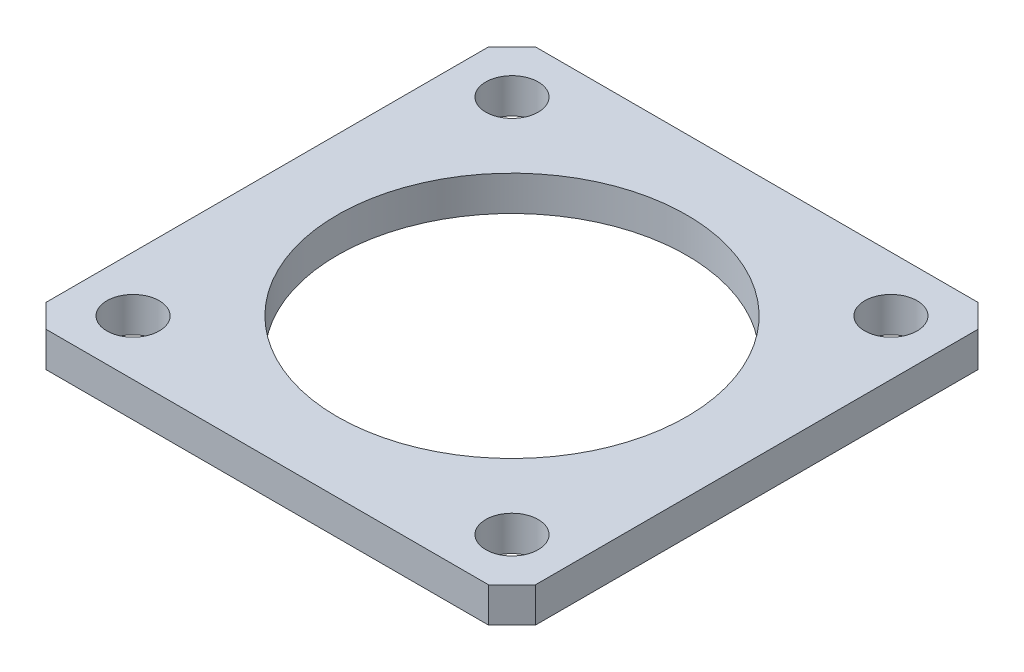
ISO-10303-21;
HEADER;
FILE_DESCRIPTION(('STEP AP214'),'2;1');
FILE_NAME('part.step','',(''),(''),'','','');
FILE_SCHEMA(('AUTOMOTIVE_DESIGN { 1 0 10303 214 1 1 1 1 }'));
ENDSEC;
DATA;
#1=APPLICATION_CONTEXT('core data for automotive mechanical design processes');
#2=APPLICATION_PROTOCOL_DEFINITION('international standard','automotive_design',2000,#1);
#3=PRODUCT_CONTEXT('',#1,'mechanical');
#4=PRODUCT('Part','Part','',(#3));
#5=PRODUCT_RELATED_PRODUCT_CATEGORY('part','',(#4));
#6=PRODUCT_DEFINITION_FORMATION('','',#4);
#7=PRODUCT_DEFINITION_CONTEXT('part definition',#1,'design');
#8=PRODUCT_DEFINITION('design','',#6,#7);
#9=PRODUCT_DEFINITION_SHAPE('','',#8);
#10=(LENGTH_UNIT() NAMED_UNIT(*) SI_UNIT(.MILLI.,.METRE.));
#11=(NAMED_UNIT(*) PLANE_ANGLE_UNIT() SI_UNIT($,.RADIAN.));
#12=(NAMED_UNIT(*) SI_UNIT($,.STERADIAN.) SOLID_ANGLE_UNIT());
#13=UNCERTAINTY_MEASURE_WITH_UNIT(LENGTH_MEASURE(1.E-05),#10,'distance_accuracy_value','');
#14=(GEOMETRIC_REPRESENTATION_CONTEXT(3) GLOBAL_UNCERTAINTY_ASSIGNED_CONTEXT((#13)) GLOBAL_UNIT_ASSIGNED_CONTEXT((#10,
#11,#12)) REPRESENTATION_CONTEXT('',''));
#15=CARTESIAN_POINT('',(0.,0.,0.));
#16=DIRECTION('',(0.,0.,1.));
#17=DIRECTION('',(1.,0.,0.));
#18=AXIS2_PLACEMENT_3D('',#15,#16,#17);
#19=CARTESIAN_POINT('',(0.,3.,0.));
#20=DIRECTION('',(0.,1.,0.));
#21=DIRECTION('',(0.,0.,1.));
#22=AXIS2_PLACEMENT_3D('',#19,#20,#21);
#23=PLANE('',#22);
#24=CARTESIAN_POINT('',(-16.2634559672906,3.,16.2634559672906));
#25=DIRECTION('',(0.,1.,0.));
#26=DIRECTION('',(0.,0.,1.));
#27=AXIS2_PLACEMENT_3D('',#24,#25,#26);
#28=CIRCLE('',#27,2.25);
#29=CARTESIAN_POINT('',(-16.2634559672906,3.,18.5134559672906));
#30=VERTEX_POINT('',#29);
#31=EDGE_CURVE('E197',#30,#30,#28,.T.);
#32=ORIENTED_EDGE('',*,*,#31,.F.);
#33=EDGE_LOOP('',(#32));
#34=FACE_BOUND('',#33,.T.);
#35=CARTESIAN_POINT('',(16.2634559672906,3.,-16.2634559672906));
#36=DIRECTION('',(0.,1.,0.));
#37=DIRECTION('',(0.,0.,1.));
#38=AXIS2_PLACEMENT_3D('',#35,#36,#37);
#39=CIRCLE('',#38,2.25);
#40=CARTESIAN_POINT('',(16.2634559672906,3.,-14.0134559672906));
#41=VERTEX_POINT('',#40);
#42=EDGE_CURVE('E185',#41,#41,#39,.T.);
#43=ORIENTED_EDGE('',*,*,#42,.F.);
#44=EDGE_LOOP('',(#43));
#45=FACE_BOUND('',#44,.T.);
#46=DIRECTION('',(0.,0.,-1.));
#47=VECTOR('',#46,1.);
#48=CARTESIAN_POINT('',(21.,3.,-19.));
#49=LINE('',#48,#47);
#50=CARTESIAN_POINT('',(21.,3.,19.));
#51=VERTEX_POINT('',#50);
#52=CARTESIAN_POINT('',(21.,3.,-19.));
#53=VERTEX_POINT('',#52);
#54=EDGE_CURVE('E148',#51,#53,#49,.T.);
#55=ORIENTED_EDGE('',*,*,#54,.T.);
#56=DIRECTION('',(-0.707106781186548,0.,-0.707106781186548));
#57=VECTOR('',#56,1.);
#58=CARTESIAN_POINT('',(19.,3.,-21.));
#59=LINE('',#58,#57);
#60=CARTESIAN_POINT('',(19.,3.,-21.));
#61=VERTEX_POINT('',#60);
#62=EDGE_CURVE('E96',#53,#61,#59,.T.);
#63=ORIENTED_EDGE('',*,*,#62,.T.);
#64=DIRECTION('',(-1.,0.,0.));
#65=VECTOR('',#64,1.);
#66=CARTESIAN_POINT('',(-19.,3.,-21.));
#67=LINE('',#66,#65);
#68=CARTESIAN_POINT('',(-19.,3.,-21.));
#69=VERTEX_POINT('',#68);
#70=EDGE_CURVE('E163',#61,#69,#67,.T.);
#71=ORIENTED_EDGE('',*,*,#70,.T.);
#72=DIRECTION('',(-0.707106781186548,0.,0.707106781186548));
#73=VECTOR('',#72,1.);
#74=CARTESIAN_POINT('',(-19.,3.,-21.));
#75=LINE('',#74,#73);
#76=CARTESIAN_POINT('',(-21.,3.,-19.));
#77=VERTEX_POINT('',#76);
#78=EDGE_CURVE('E176',#69,#77,#75,.T.);
#79=ORIENTED_EDGE('',*,*,#78,.T.);
#80=DIRECTION('',(0.,0.,1.));
#81=VECTOR('',#80,1.);
#82=CARTESIAN_POINT('',(-21.,3.,-19.));
#83=LINE('',#82,#81);
#84=CARTESIAN_POINT('',(-21.,3.,19.));
#85=VERTEX_POINT('',#84);
#86=EDGE_CURVE('E115',#77,#85,#83,.T.);
#87=ORIENTED_EDGE('',*,*,#86,.T.);
#88=DIRECTION('',(0.707106781186547,0.,0.707106781186548));
#89=VECTOR('',#88,1.);
#90=CARTESIAN_POINT('',(-21.,3.,19.));
#91=LINE('',#90,#89);
#92=CARTESIAN_POINT('',(-19.,3.,21.));
#93=VERTEX_POINT('',#92);
#94=EDGE_CURVE('E109',#85,#93,#91,.T.);
#95=ORIENTED_EDGE('',*,*,#94,.T.);
#96=DIRECTION('',(1.,0.,0.));
#97=VECTOR('',#96,1.);
#98=CARTESIAN_POINT('',(-19.,3.,21.));
#99=LINE('',#98,#97);
#100=CARTESIAN_POINT('',(19.,3.,21.));
#101=VERTEX_POINT('',#100);
#102=EDGE_CURVE('E113',#93,#101,#99,.T.);
#103=ORIENTED_EDGE('',*,*,#102,.T.);
#104=DIRECTION('',(0.707106781186548,0.,-0.707106781186547));
#105=VECTOR('',#104,1.);
#106=CARTESIAN_POINT('',(21.,3.,19.));
#107=LINE('',#106,#105);
#108=EDGE_CURVE('E53',#101,#51,#107,.T.);
#109=ORIENTED_EDGE('',*,*,#108,.T.);
#110=EDGE_LOOP('',(#55,#63,#71,#79,#87,#95,#103,#109));
#111=FACE_BOUND('',#110,.T.);
#112=CARTESIAN_POINT('',(-16.2634559672906,3.,-16.2634559672906));
#113=DIRECTION('',(0.,1.,0.));
#114=DIRECTION('',(0.,0.,1.));
#115=AXIS2_PLACEMENT_3D('',#112,#113,#114);
#116=CIRCLE('',#115,2.25);
#117=CARTESIAN_POINT('',(-16.2634559672906,3.,-14.0134559672906));
#118=VERTEX_POINT('',#117);
#119=EDGE_CURVE('E137',#118,#118,#116,.T.);
#120=ORIENTED_EDGE('',*,*,#119,.F.);
#121=EDGE_LOOP('',(#120));
#122=FACE_BOUND('',#121,.T.);
#123=CARTESIAN_POINT('',(16.2634559672906,3.,16.2634559672906));
#124=DIRECTION('',(0.,1.,0.));
#125=DIRECTION('',(0.,0.,1.));
#126=AXIS2_PLACEMENT_3D('',#123,#124,#125);
#127=CIRCLE('',#126,2.25);
#128=CARTESIAN_POINT('',(16.2634559672906,3.,18.5134559672906));
#129=VERTEX_POINT('',#128);
#130=EDGE_CURVE('E191',#129,#129,#127,.T.);
#131=ORIENTED_EDGE('',*,*,#130,.F.);
#132=EDGE_LOOP('',(#131));
#133=FACE_BOUND('',#132,.T.);
#134=CARTESIAN_POINT('',(0.,3.,0.));
#135=DIRECTION('',(0.,1.,0.));
#136=DIRECTION('',(0.,0.,1.));
#137=AXIS2_PLACEMENT_3D('',#134,#135,#136);
#138=CIRCLE('',#137,15.);
#139=CARTESIAN_POINT('',(0.,3.,15.));
#140=VERTEX_POINT('',#139);
#141=EDGE_CURVE('E203',#140,#140,#138,.T.);
#142=ORIENTED_EDGE('',*,*,#141,.F.);
#143=EDGE_LOOP('',(#142));
#144=FACE_BOUND('',#143,.T.);
#145=ADVANCED_FACE('F36',(#34,#45,#111,#122,#133,#144),#23,.T.);
#146=CARTESIAN_POINT('',(0.,0.,0.));
#147=DIRECTION('',(0.,1.,0.));
#148=DIRECTION('',(0.,0.,1.));
#149=AXIS2_PLACEMENT_3D('',#146,#147,#148);
#150=PLANE('',#149);
#151=DIRECTION('',(0.,0.,-1.));
#152=VECTOR('',#151,1.);
#153=CARTESIAN_POINT('',(21.,0.,-19.));
#154=LINE('',#153,#152);
#155=CARTESIAN_POINT('',(21.,0.,19.));
#156=VERTEX_POINT('',#155);
#157=CARTESIAN_POINT('',(21.,0.,-19.));
#158=VERTEX_POINT('',#157);
#159=EDGE_CURVE('E133',#156,#158,#154,.T.);
#160=ORIENTED_EDGE('',*,*,#159,.F.);
#161=DIRECTION('',(0.707106781186548,0.,-0.707106781186547));
#162=VECTOR('',#161,1.);
#163=CARTESIAN_POINT('',(21.,0.,19.));
#164=LINE('',#163,#162);
#165=CARTESIAN_POINT('',(19.,0.,21.));
#166=VERTEX_POINT('',#165);
#167=EDGE_CURVE('E88',#166,#156,#164,.T.);
#168=ORIENTED_EDGE('',*,*,#167,.F.);
#169=DIRECTION('',(1.,0.,0.));
#170=VECTOR('',#169,1.);
#171=CARTESIAN_POINT('',(-19.,0.,21.));
#172=LINE('',#171,#170);
#173=CARTESIAN_POINT('',(-19.,0.,21.));
#174=VERTEX_POINT('',#173);
#175=EDGE_CURVE('E82',#174,#166,#172,.T.);
#176=ORIENTED_EDGE('',*,*,#175,.F.);
#177=DIRECTION('',(0.707106781186547,0.,0.707106781186548));
#178=VECTOR('',#177,1.);
#179=CARTESIAN_POINT('',(-21.,0.,19.));
#180=LINE('',#179,#178);
#181=CARTESIAN_POINT('',(-21.,0.,19.));
#182=VERTEX_POINT('',#181);
#183=EDGE_CURVE('E123',#182,#174,#180,.T.);
#184=ORIENTED_EDGE('',*,*,#183,.F.);
#185=DIRECTION('',(0.,0.,1.));
#186=VECTOR('',#185,1.);
#187=CARTESIAN_POINT('',(-21.,0.,-19.));
#188=LINE('',#187,#186);
#189=CARTESIAN_POINT('',(-21.,0.,-19.));
#190=VERTEX_POINT('',#189);
#191=EDGE_CURVE('E143',#190,#182,#188,.T.);
#192=ORIENTED_EDGE('',*,*,#191,.F.);
#193=DIRECTION('',(-0.707106781186548,0.,0.707106781186548));
#194=VECTOR('',#193,1.);
#195=CARTESIAN_POINT('',(-19.,0.,-21.));
#196=LINE('',#195,#194);
#197=CARTESIAN_POINT('',(-19.,0.,-21.));
#198=VERTEX_POINT('',#197);
#199=EDGE_CURVE('E141',#198,#190,#196,.T.);
#200=ORIENTED_EDGE('',*,*,#199,.F.);
#201=DIRECTION('',(-1.,0.,0.));
#202=VECTOR('',#201,1.);
#203=CARTESIAN_POINT('',(-19.,0.,-21.));
#204=LINE('',#203,#202);
#205=CARTESIAN_POINT('',(19.,0.,-21.));
#206=VERTEX_POINT('',#205);
#207=EDGE_CURVE('E139',#206,#198,#204,.T.);
#208=ORIENTED_EDGE('',*,*,#207,.F.);
#209=DIRECTION('',(-0.707106781186548,0.,-0.707106781186548));
#210=VECTOR('',#209,1.);
#211=CARTESIAN_POINT('',(19.,0.,-21.));
#212=LINE('',#211,#210);
#213=EDGE_CURVE('E136',#158,#206,#212,.T.);
#214=ORIENTED_EDGE('',*,*,#213,.F.);
#215=EDGE_LOOP('',(#160,#168,#176,#184,#192,#200,#208,#214));
#216=FACE_BOUND('',#215,.T.);
#217=CARTESIAN_POINT('',(-16.2634559672906,0.,-16.2634559672906));
#218=DIRECTION('',(0.,1.,0.));
#219=DIRECTION('',(0.,0.,1.));
#220=AXIS2_PLACEMENT_3D('',#217,#218,#219);
#221=CIRCLE('',#220,2.25);
#222=CARTESIAN_POINT('',(-16.2634559672906,0.,-14.0134559672906));
#223=VERTEX_POINT('',#222);
#224=EDGE_CURVE('E182',#223,#223,#221,.T.);
#225=ORIENTED_EDGE('',*,*,#224,.T.);
#226=EDGE_LOOP('',(#225));
#227=FACE_BOUND('',#226,.T.);
#228=CARTESIAN_POINT('',(16.2634559672906,0.,-16.2634559672906));
#229=DIRECTION('',(0.,1.,0.));
#230=DIRECTION('',(0.,0.,1.));
#231=AXIS2_PLACEMENT_3D('',#228,#229,#230);
#232=CIRCLE('',#231,2.25);
#233=CARTESIAN_POINT('',(16.2634559672906,0.,-14.0134559672906));
#234=VERTEX_POINT('',#233);
#235=EDGE_CURVE('E188',#234,#234,#232,.T.);
#236=ORIENTED_EDGE('',*,*,#235,.T.);
#237=EDGE_LOOP('',(#236));
#238=FACE_BOUND('',#237,.T.);
#239=CARTESIAN_POINT('',(16.2634559672906,0.,16.2634559672906));
#240=DIRECTION('',(0.,1.,0.));
#241=DIRECTION('',(0.,0.,1.));
#242=AXIS2_PLACEMENT_3D('',#239,#240,#241);
#243=CIRCLE('',#242,2.25);
#244=CARTESIAN_POINT('',(16.2634559672906,0.,18.5134559672906));
#245=VERTEX_POINT('',#244);
#246=EDGE_CURVE('E194',#245,#245,#243,.T.);
#247=ORIENTED_EDGE('',*,*,#246,.T.);
#248=EDGE_LOOP('',(#247));
#249=FACE_BOUND('',#248,.T.);
#250=CARTESIAN_POINT('',(-16.2634559672906,0.,16.2634559672906));
#251=DIRECTION('',(0.,1.,0.));
#252=DIRECTION('',(0.,0.,1.));
#253=AXIS2_PLACEMENT_3D('',#250,#251,#252);
#254=CIRCLE('',#253,2.25);
#255=CARTESIAN_POINT('',(-16.2634559672906,0.,18.5134559672906));
#256=VERTEX_POINT('',#255);
#257=EDGE_CURVE('E200',#256,#256,#254,.T.);
#258=ORIENTED_EDGE('',*,*,#257,.T.);
#259=EDGE_LOOP('',(#258));
#260=FACE_BOUND('',#259,.T.);
#261=CARTESIAN_POINT('',(0.,0.,0.));
#262=DIRECTION('',(0.,1.,0.));
#263=DIRECTION('',(0.,0.,1.));
#264=AXIS2_PLACEMENT_3D('',#261,#262,#263);
#265=CIRCLE('',#264,15.);
#266=CARTESIAN_POINT('',(0.,0.,15.));
#267=VERTEX_POINT('',#266);
#268=EDGE_CURVE('E206',#267,#267,#265,.T.);
#269=ORIENTED_EDGE('',*,*,#268,.T.);
#270=EDGE_LOOP('',(#269));
#271=FACE_BOUND('',#270,.T.);
#272=ADVANCED_FACE('F167',(#216,#227,#238,#249,#260,#271),#150,.F.);
#273=CARTESIAN_POINT('',(21.,3.,-19.));
#274=DIRECTION('',(-1.,0.,0.));
#275=DIRECTION('',(0.,0.,1.));
#276=AXIS2_PLACEMENT_3D('',#273,#274,#275);
#277=PLANE('',#276);
#278=ORIENTED_EDGE('',*,*,#159,.T.);
#279=DIRECTION('',(0.,-1.,0.));
#280=VECTOR('',#279,1.);
#281=CARTESIAN_POINT('',(21.,3.,-19.));
#282=LINE('',#281,#280);
#283=EDGE_CURVE('E11',#53,#158,#282,.T.);
#284=ORIENTED_EDGE('',*,*,#283,.F.);
#285=ORIENTED_EDGE('',*,*,#54,.F.);
#286=DIRECTION('',(0.,-1.,0.));
#287=VECTOR('',#286,1.);
#288=CARTESIAN_POINT('',(21.,3.,19.));
#289=LINE('',#288,#287);
#290=EDGE_CURVE('E129',#51,#156,#289,.T.);
#291=ORIENTED_EDGE('',*,*,#290,.T.);
#292=EDGE_LOOP('',(#278,#284,#285,#291));
#293=FACE_BOUND('',#292,.T.);
#294=ADVANCED_FACE('F38',(#293),#277,.F.);
#295=CARTESIAN_POINT('',(19.,3.,-21.));
#296=DIRECTION('',(-0.707106781186548,0.,0.707106781186548));
#297=DIRECTION('',(0.707106781186548,0.,0.707106781186548));
#298=AXIS2_PLACEMENT_3D('',#295,#296,#297);
#299=PLANE('',#298);
#300=ORIENTED_EDGE('',*,*,#213,.T.);
#301=DIRECTION('',(0.,-1.,0.));
#302=VECTOR('',#301,1.);
#303=CARTESIAN_POINT('',(19.,3.,-21.));
#304=LINE('',#303,#302);
#305=EDGE_CURVE('E45',#61,#206,#304,.T.);
#306=ORIENTED_EDGE('',*,*,#305,.F.);
#307=ORIENTED_EDGE('',*,*,#62,.F.);
#308=ORIENTED_EDGE('',*,*,#283,.T.);
#309=EDGE_LOOP('',(#300,#306,#307,#308));
#310=FACE_BOUND('',#309,.T.);
#311=ADVANCED_FACE('F240',(#310),#299,.F.);
#312=CARTESIAN_POINT('',(-19.,3.,-21.));
#313=DIRECTION('',(0.,0.,1.));
#314=DIRECTION('',(1.,0.,0.));
#315=AXIS2_PLACEMENT_3D('',#312,#313,#314);
#316=PLANE('',#315);
#317=ORIENTED_EDGE('',*,*,#207,.T.);
#318=DIRECTION('',(0.,-1.,0.));
#319=VECTOR('',#318,1.);
#320=CARTESIAN_POINT('',(-19.,3.,-21.));
#321=LINE('',#320,#319);
#322=EDGE_CURVE('E155',#69,#198,#321,.T.);
#323=ORIENTED_EDGE('',*,*,#322,.F.);
#324=ORIENTED_EDGE('',*,*,#70,.F.);
#325=ORIENTED_EDGE('',*,*,#305,.T.);
#326=EDGE_LOOP('',(#317,#323,#324,#325));
#327=FACE_BOUND('',#326,.T.);
#328=ADVANCED_FACE('F161',(#327),#316,.F.);
#329=CARTESIAN_POINT('',(-19.,3.,-21.));
#330=DIRECTION('',(0.707106781186548,0.,0.707106781186548));
#331=DIRECTION('',(0.707106781186548,0.,-0.707106781186548));
#332=AXIS2_PLACEMENT_3D('',#329,#330,#331);
#333=PLANE('',#332);
#334=ORIENTED_EDGE('',*,*,#199,.T.);
#335=DIRECTION('',(0.,-1.,0.));
#336=VECTOR('',#335,1.);
#337=CARTESIAN_POINT('',(-21.,3.,-19.));
#338=LINE('',#337,#336);
#339=EDGE_CURVE('E152',#77,#190,#338,.T.);
#340=ORIENTED_EDGE('',*,*,#339,.F.);
#341=ORIENTED_EDGE('',*,*,#78,.F.);
#342=ORIENTED_EDGE('',*,*,#322,.T.);
#343=EDGE_LOOP('',(#334,#340,#341,#342));
#344=FACE_BOUND('',#343,.T.);
#345=ADVANCED_FACE('F172',(#344),#333,.F.);
#346=CARTESIAN_POINT('',(-21.,3.,-19.));
#347=DIRECTION('',(1.,0.,0.));
#348=DIRECTION('',(0.,0.,-1.));
#349=AXIS2_PLACEMENT_3D('',#346,#347,#348);
#350=PLANE('',#349);
#351=ORIENTED_EDGE('',*,*,#191,.T.);
#352=DIRECTION('',(0.,-1.,0.));
#353=VECTOR('',#352,1.);
#354=CARTESIAN_POINT('',(-21.,3.,19.));
#355=LINE('',#354,#353);
#356=EDGE_CURVE('E124',#85,#182,#355,.T.);
#357=ORIENTED_EDGE('',*,*,#356,.F.);
#358=ORIENTED_EDGE('',*,*,#86,.F.);
#359=ORIENTED_EDGE('',*,*,#339,.T.);
#360=EDGE_LOOP('',(#351,#357,#358,#359));
#361=FACE_BOUND('',#360,.T.);
#362=ADVANCED_FACE('F175',(#361),#350,.F.);
#363=CARTESIAN_POINT('',(-21.,3.,19.));
#364=DIRECTION('',(0.707106781186548,0.,-0.707106781186547));
#365=DIRECTION('',(-0.707106781186547,0.,-0.707106781186548));
#366=AXIS2_PLACEMENT_3D('',#363,#364,#365);
#367=PLANE('',#366);
#368=ORIENTED_EDGE('',*,*,#183,.T.);
#369=DIRECTION('',(0.,-1.,0.));
#370=VECTOR('',#369,1.);
#371=CARTESIAN_POINT('',(-19.,3.,21.));
#372=LINE('',#371,#370);
#373=EDGE_CURVE('E120',#93,#174,#372,.T.);
#374=ORIENTED_EDGE('',*,*,#373,.F.);
#375=ORIENTED_EDGE('',*,*,#94,.F.);
#376=ORIENTED_EDGE('',*,*,#356,.T.);
#377=EDGE_LOOP('',(#368,#374,#375,#376));
#378=FACE_BOUND('',#377,.T.);
#379=ADVANCED_FACE('F121',(#378),#367,.F.);
#380=CARTESIAN_POINT('',(-19.,3.,21.));
#381=DIRECTION('',(0.,0.,-1.));
#382=DIRECTION('',(-1.,0.,0.));
#383=AXIS2_PLACEMENT_3D('',#380,#381,#382);
#384=PLANE('',#383);
#385=ORIENTED_EDGE('',*,*,#175,.T.);
#386=DIRECTION('',(0.,-1.,0.));
#387=VECTOR('',#386,1.);
#388=CARTESIAN_POINT('',(19.,3.,21.));
#389=LINE('',#388,#387);
#390=EDGE_CURVE('E125',#101,#166,#389,.T.);
#391=ORIENTED_EDGE('',*,*,#390,.F.);
#392=ORIENTED_EDGE('',*,*,#102,.F.);
#393=ORIENTED_EDGE('',*,*,#373,.T.);
#394=EDGE_LOOP('',(#385,#391,#392,#393));
#395=FACE_BOUND('',#394,.T.);
#396=ADVANCED_FACE('F127',(#395),#384,.F.);
#397=CARTESIAN_POINT('',(21.,3.,19.));
#398=DIRECTION('',(-0.707106781186547,0.,-0.707106781186548));
#399=DIRECTION('',(-0.707106781186548,0.,0.707106781186547));
#400=AXIS2_PLACEMENT_3D('',#397,#398,#399);
#401=PLANE('',#400);
#402=ORIENTED_EDGE('',*,*,#167,.T.);
#403=ORIENTED_EDGE('',*,*,#290,.F.);
#404=ORIENTED_EDGE('',*,*,#108,.F.);
#405=ORIENTED_EDGE('',*,*,#390,.T.);
#406=EDGE_LOOP('',(#402,#403,#404,#405));
#407=FACE_BOUND('',#406,.T.);
#408=ADVANCED_FACE('F228',(#407),#401,.F.);
#409=CARTESIAN_POINT('',(-16.2634559672906,3.,-16.2634559672906));
#410=DIRECTION('',(0.,-1.,0.));
#411=DIRECTION('',(0.,0.,-1.));
#412=AXIS2_PLACEMENT_3D('',#409,#410,#411);
#413=CYLINDRICAL_SURFACE('',#412,2.25);
#414=ORIENTED_EDGE('',*,*,#119,.T.);
#415=EDGE_LOOP('',(#414));
#416=FACE_BOUND('',#415,.T.);
#417=ORIENTED_EDGE('',*,*,#224,.F.);
#418=EDGE_LOOP('',(#417));
#419=FACE_BOUND('',#418,.T.);
#420=ADVANCED_FACE('F225',(#416,#419),#413,.F.);
#421=CARTESIAN_POINT('',(16.2634559672906,3.,-16.2634559672906));
#422=DIRECTION('',(0.,-1.,0.));
#423=DIRECTION('',(0.,0.,-1.));
#424=AXIS2_PLACEMENT_3D('',#421,#422,#423);
#425=CYLINDRICAL_SURFACE('',#424,2.25);
#426=ORIENTED_EDGE('',*,*,#42,.T.);
#427=EDGE_LOOP('',(#426));
#428=FACE_BOUND('',#427,.T.);
#429=ORIENTED_EDGE('',*,*,#235,.F.);
#430=EDGE_LOOP('',(#429));
#431=FACE_BOUND('',#430,.T.);
#432=ADVANCED_FACE('F304',(#428,#431),#425,.F.);
#433=CARTESIAN_POINT('',(16.2634559672906,3.,16.2634559672906));
#434=DIRECTION('',(0.,-1.,0.));
#435=DIRECTION('',(0.,0.,-1.));
#436=AXIS2_PLACEMENT_3D('',#433,#434,#435);
#437=CYLINDRICAL_SURFACE('',#436,2.25);
#438=ORIENTED_EDGE('',*,*,#130,.T.);
#439=EDGE_LOOP('',(#438));
#440=FACE_BOUND('',#439,.T.);
#441=ORIENTED_EDGE('',*,*,#246,.F.);
#442=EDGE_LOOP('',(#441));
#443=FACE_BOUND('',#442,.T.);
#444=ADVANCED_FACE('F312',(#440,#443),#437,.F.);
#445=CARTESIAN_POINT('',(-16.2634559672906,3.,16.2634559672906));
#446=DIRECTION('',(0.,-1.,0.));
#447=DIRECTION('',(0.,0.,-1.));
#448=AXIS2_PLACEMENT_3D('',#445,#446,#447);
#449=CYLINDRICAL_SURFACE('',#448,2.25);
#450=ORIENTED_EDGE('',*,*,#31,.T.);
#451=EDGE_LOOP('',(#450));
#452=FACE_BOUND('',#451,.T.);
#453=ORIENTED_EDGE('',*,*,#257,.F.);
#454=EDGE_LOOP('',(#453));
#455=FACE_BOUND('',#454,.T.);
#456=ADVANCED_FACE('F320',(#452,#455),#449,.F.);
#457=CARTESIAN_POINT('',(0.,3.,0.));
#458=DIRECTION('',(0.,-1.,0.));
#459=DIRECTION('',(0.,0.,-1.));
#460=AXIS2_PLACEMENT_3D('',#457,#458,#459);
#461=CYLINDRICAL_SURFACE('',#460,15.);
#462=ORIENTED_EDGE('',*,*,#141,.T.);
#463=EDGE_LOOP('',(#462));
#464=FACE_BOUND('',#463,.T.);
#465=ORIENTED_EDGE('',*,*,#268,.F.);
#466=EDGE_LOOP('',(#465));
#467=FACE_BOUND('',#466,.T.);
#468=ADVANCED_FACE('F212',(#464,#467),#461,.F.);
#469=CLOSED_SHELL('',(#145,#272,#294,#311,#328,#345,#362,#379,#396,#408,#420,#432,#444,#456,#468));
#470=MANIFOLD_SOLID_BREP('B2',#469);
#471=ADVANCED_BREP_SHAPE_REPRESENTATION('',(#18,#470),#14);
#472=SHAPE_DEFINITION_REPRESENTATION(#9,#471);
ENDSEC;
END-ISO-10303-21;
